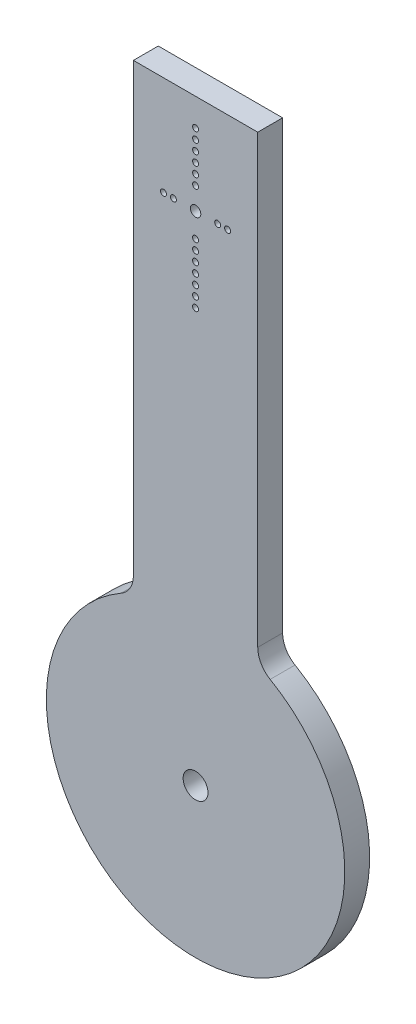
ISO-10303-21;
HEADER;
FILE_DESCRIPTION(('STEP AP214'),'2;1');
FILE_NAME('part.step','',(''),(''),'','','');
FILE_SCHEMA(('AUTOMOTIVE_DESIGN { 1 0 10303 214 1 1 1 1 }'));
ENDSEC;
DATA;
#1=APPLICATION_CONTEXT('core data for automotive mechanical design processes');
#2=APPLICATION_PROTOCOL_DEFINITION('international standard','automotive_design',2000,#1);
#3=PRODUCT_CONTEXT('',#1,'mechanical');
#4=PRODUCT('Part','Part','',(#3));
#5=PRODUCT_RELATED_PRODUCT_CATEGORY('part','',(#4));
#6=PRODUCT_DEFINITION_FORMATION('','',#4);
#7=PRODUCT_DEFINITION_CONTEXT('part definition',#1,'design');
#8=PRODUCT_DEFINITION('design','',#6,#7);
#9=PRODUCT_DEFINITION_SHAPE('','',#8);
#10=(LENGTH_UNIT() NAMED_UNIT(*) SI_UNIT(.MILLI.,.METRE.));
#11=(NAMED_UNIT(*) PLANE_ANGLE_UNIT() SI_UNIT($,.RADIAN.));
#12=(NAMED_UNIT(*) SI_UNIT($,.STERADIAN.) SOLID_ANGLE_UNIT());
#13=UNCERTAINTY_MEASURE_WITH_UNIT(LENGTH_MEASURE(1.E-05),#10,'distance_accuracy_value','');
#14=(GEOMETRIC_REPRESENTATION_CONTEXT(3) GLOBAL_UNCERTAINTY_ASSIGNED_CONTEXT((#13)) GLOBAL_UNIT_ASSIGNED_CONTEXT((#10,
#11,#12)) REPRESENTATION_CONTEXT('',''));
#15=CARTESIAN_POINT('',(0.,0.,0.));
#16=DIRECTION('',(0.,0.,1.));
#17=DIRECTION('',(1.,0.,0.));
#18=AXIS2_PLACEMENT_3D('',#15,#16,#17);
#19=CARTESIAN_POINT('',(-17.5,30.3108891324554,5.));
#20=DIRECTION('',(0.,0.,1.));
#21=DIRECTION('',(1.,0.,0.));
#22=AXIS2_PLACEMENT_3D('',#19,#20,#21);
#23=PLANE('',#22);
#24=CARTESIAN_POINT('',(0.,114.45,5.));
#25=DIRECTION('',(0.,0.,1.));
#26=DIRECTION('',(1.,0.,0.));
#27=AXIS2_PLACEMENT_3D('',#24,#25,#26);
#28=CIRCLE('',#27,0.599999999999914);
#29=CARTESIAN_POINT('',(0.599999999999921,114.45,5.));
#30=VERTEX_POINT('',#29);
#31=EDGE_CURVE('E249',#30,#30,#28,.T.);
#32=ORIENTED_EDGE('',*,*,#31,.F.);
#33=EDGE_LOOP('',(#32));
#34=FACE_BOUND('',#33,.T.);
#35=CARTESIAN_POINT('',(0.,110.45,5.));
#36=DIRECTION('',(0.,0.,1.));
#37=DIRECTION('',(1.,0.,0.));
#38=AXIS2_PLACEMENT_3D('',#35,#36,#37);
#39=CIRCLE('',#38,0.599999999999914);
#40=CARTESIAN_POINT('',(0.599999999999921,110.45,5.));
#41=VERTEX_POINT('',#40);
#42=EDGE_CURVE('E261',#41,#41,#39,.T.);
#43=ORIENTED_EDGE('',*,*,#42,.F.);
#44=EDGE_LOOP('',(#43));
#45=FACE_BOUND('',#44,.T.);
#46=CARTESIAN_POINT('',(0.,106.45,5.));
#47=DIRECTION('',(0.,0.,1.));
#48=DIRECTION('',(1.,0.,0.));
#49=AXIS2_PLACEMENT_3D('',#46,#47,#48);
#50=CIRCLE('',#49,0.599999999999914);
#51=CARTESIAN_POINT('',(0.599999999999921,106.45,5.));
#52=VERTEX_POINT('',#51);
#53=EDGE_CURVE('E273',#52,#52,#50,.T.);
#54=ORIENTED_EDGE('',*,*,#53,.F.);
#55=EDGE_LOOP('',(#54));
#56=FACE_BOUND('',#55,.T.);
#57=CARTESIAN_POINT('',(-6.44999999999999,100.,5.));
#58=DIRECTION('',(0.,0.,1.));
#59=DIRECTION('',(1.,0.,0.));
#60=AXIS2_PLACEMENT_3D('',#57,#58,#59);
#61=CIRCLE('',#60,0.599999999999908);
#62=CARTESIAN_POINT('',(-5.85000000000008,100.,5.));
#63=VERTEX_POINT('',#62);
#64=EDGE_CURVE('E285',#63,#63,#61,.T.);
#65=ORIENTED_EDGE('',*,*,#64,.F.);
#66=EDGE_LOOP('',(#65));
#67=FACE_BOUND('',#66,.T.);
#68=CARTESIAN_POINT('',(4.45000000000001,100.,5.));
#69=DIRECTION('',(0.,0.,1.));
#70=DIRECTION('',(1.,0.,0.));
#71=AXIS2_PLACEMENT_3D('',#68,#69,#70);
#72=CIRCLE('',#71,0.599999999999908);
#73=CARTESIAN_POINT('',(5.04999999999992,100.,5.));
#74=VERTEX_POINT('',#73);
#75=EDGE_CURVE('E297',#74,#74,#72,.T.);
#76=ORIENTED_EDGE('',*,*,#75,.F.);
#77=EDGE_LOOP('',(#76));
#78=FACE_BOUND('',#77,.T.);
#79=CARTESIAN_POINT('',(0.,83.15,5.));
#80=DIRECTION('',(0.,0.,1.));
#81=DIRECTION('',(1.,0.,0.));
#82=AXIS2_PLACEMENT_3D('',#79,#80,#81);
#83=CIRCLE('',#82,0.599999999999914);
#84=CARTESIAN_POINT('',(0.599999999999921,83.15,5.));
#85=VERTEX_POINT('',#84);
#86=EDGE_CURVE('E309',#85,#85,#83,.T.);
#87=ORIENTED_EDGE('',*,*,#86,.F.);
#88=EDGE_LOOP('',(#87));
#89=FACE_BOUND('',#88,.T.);
#90=CARTESIAN_POINT('',(0.,87.15,5.));
#91=DIRECTION('',(0.,0.,1.));
#92=DIRECTION('',(1.,0.,0.));
#93=AXIS2_PLACEMENT_3D('',#90,#91,#92);
#94=CIRCLE('',#93,0.599999999999914);
#95=CARTESIAN_POINT('',(0.599999999999921,87.15,5.));
#96=VERTEX_POINT('',#95);
#97=EDGE_CURVE('E321',#96,#96,#94,.T.);
#98=ORIENTED_EDGE('',*,*,#97,.F.);
#99=EDGE_LOOP('',(#98));
#100=FACE_BOUND('',#99,.T.);
#101=CARTESIAN_POINT('',(0.,91.15,5.));
#102=DIRECTION('',(0.,0.,1.));
#103=DIRECTION('',(1.,0.,0.));
#104=AXIS2_PLACEMENT_3D('',#101,#102,#103);
#105=CIRCLE('',#104,0.599999999999914);
#106=CARTESIAN_POINT('',(0.599999999999921,91.15,5.));
#107=VERTEX_POINT('',#106);
#108=EDGE_CURVE('E333',#107,#107,#105,.T.);
#109=ORIENTED_EDGE('',*,*,#108,.F.);
#110=EDGE_LOOP('',(#109));
#111=FACE_BOUND('',#110,.T.);
#112=CARTESIAN_POINT('',(0.,95.15,5.));
#113=DIRECTION('',(0.,0.,1.));
#114=DIRECTION('',(1.,0.,0.));
#115=AXIS2_PLACEMENT_3D('',#112,#113,#114);
#116=CIRCLE('',#115,0.599999999999914);
#117=CARTESIAN_POINT('',(0.599999999999921,95.15,5.));
#118=VERTEX_POINT('',#117);
#119=EDGE_CURVE('E345',#118,#118,#116,.T.);
#120=ORIENTED_EDGE('',*,*,#119,.F.);
#121=EDGE_LOOP('',(#120));
#122=FACE_BOUND('',#121,.T.);
#123=DIRECTION('',(0.,-1.,0.));
#124=VECTOR('',#123,1.);
#125=CARTESIAN_POINT('',(-12.5,120.,5.));
#126=LINE('',#125,#124);
#127=CARTESIAN_POINT('',(-12.5,120.,5.));
#128=VERTEX_POINT('',#127);
#129=CARTESIAN_POINT('',(-12.5,30.3108891324554,5.));
#130=VERTEX_POINT('',#129);
#131=EDGE_CURVE('E129',#128,#130,#126,.T.);
#132=ORIENTED_EDGE('',*,*,#131,.T.);
#133=CARTESIAN_POINT('',(-17.5,30.3108891324554,5.));
#134=DIRECTION('',(0.,0.,-1.));
#135=DIRECTION('',(1.,0.,0.));
#136=AXIS2_PLACEMENT_3D('',#133,#134,#135);
#137=CIRCLE('',#136,5.);
#138=CARTESIAN_POINT('',(-15.,25.9807621135332,5.));
#139=VERTEX_POINT('',#138);
#140=EDGE_CURVE('E87',#130,#139,#137,.T.);
#141=ORIENTED_EDGE('',*,*,#140,.T.);
#142=CARTESIAN_POINT('',(0.,0.,5.));
#143=DIRECTION('',(0.,0.,1.));
#144=DIRECTION('',(1.,0.,0.));
#145=AXIS2_PLACEMENT_3D('',#142,#143,#144);
#146=CIRCLE('',#145,30.);
#147=CARTESIAN_POINT('',(15.,25.9807621135332,5.));
#148=VERTEX_POINT('',#147);
#149=EDGE_CURVE('E100',#139,#148,#146,.T.);
#150=ORIENTED_EDGE('',*,*,#149,.T.);
#151=CARTESIAN_POINT('',(17.5,30.3108891324554,5.));
#152=DIRECTION('',(0.,0.,-1.));
#153=DIRECTION('',(-1.,0.,0.));
#154=AXIS2_PLACEMENT_3D('',#151,#152,#153);
#155=CIRCLE('',#154,5.);
#156=CARTESIAN_POINT('',(12.5,30.3108891324554,5.));
#157=VERTEX_POINT('',#156);
#158=EDGE_CURVE('E94',#148,#157,#155,.T.);
#159=ORIENTED_EDGE('',*,*,#158,.T.);
#160=DIRECTION('',(0.,1.,0.));
#161=VECTOR('',#160,1.);
#162=CARTESIAN_POINT('',(12.5,120.,5.));
#163=LINE('',#162,#161);
#164=CARTESIAN_POINT('',(12.5,120.,5.));
#165=VERTEX_POINT('',#164);
#166=EDGE_CURVE('E98',#157,#165,#163,.T.);
#167=ORIENTED_EDGE('',*,*,#166,.T.);
#168=DIRECTION('',(-1.,0.,0.));
#169=VECTOR('',#168,1.);
#170=CARTESIAN_POINT('',(-12.5,120.,5.));
#171=LINE('',#170,#169);
#172=EDGE_CURVE('E50',#165,#128,#171,.T.);
#173=ORIENTED_EDGE('',*,*,#172,.T.);
#174=EDGE_LOOP('',(#132,#141,#150,#159,#167,#173));
#175=FACE_BOUND('',#174,.T.);
#176=CARTESIAN_POINT('',(0.,100.,5.));
#177=DIRECTION('',(0.,0.,1.));
#178=DIRECTION('',(1.,0.,0.));
#179=AXIS2_PLACEMENT_3D('',#176,#177,#178);
#180=CIRCLE('',#179,1.0499999999999);
#181=CARTESIAN_POINT('',(1.04999999999991,100.,5.));
#182=VERTEX_POINT('',#181);
#183=EDGE_CURVE('E122',#182,#182,#180,.T.);
#184=ORIENTED_EDGE('',*,*,#183,.F.);
#185=EDGE_LOOP('',(#184));
#186=FACE_BOUND('',#185,.T.);
#187=CARTESIAN_POINT('',(0.,93.15,5.));
#188=DIRECTION('',(0.,0.,1.));
#189=DIRECTION('',(1.,0.,0.));
#190=AXIS2_PLACEMENT_3D('',#187,#188,#189);
#191=CIRCLE('',#190,0.599999999999914);
#192=CARTESIAN_POINT('',(0.599999999999921,93.15,5.));
#193=VERTEX_POINT('',#192);
#194=EDGE_CURVE('E339',#193,#193,#191,.T.);
#195=ORIENTED_EDGE('',*,*,#194,.F.);
#196=EDGE_LOOP('',(#195));
#197=FACE_BOUND('',#196,.T.);
#198=CARTESIAN_POINT('',(0.,89.15,5.));
#199=DIRECTION('',(0.,0.,1.));
#200=DIRECTION('',(1.,0.,0.));
#201=AXIS2_PLACEMENT_3D('',#198,#199,#200);
#202=CIRCLE('',#201,0.599999999999914);
#203=CARTESIAN_POINT('',(0.599999999999921,89.15,5.));
#204=VERTEX_POINT('',#203);
#205=EDGE_CURVE('E327',#204,#204,#202,.T.);
#206=ORIENTED_EDGE('',*,*,#205,.F.);
#207=EDGE_LOOP('',(#206));
#208=FACE_BOUND('',#207,.T.);
#209=CARTESIAN_POINT('',(0.,85.15,5.));
#210=DIRECTION('',(0.,0.,1.));
#211=DIRECTION('',(1.,0.,0.));
#212=AXIS2_PLACEMENT_3D('',#209,#210,#211);
#213=CIRCLE('',#212,0.599999999999914);
#214=CARTESIAN_POINT('',(0.599999999999921,85.15,5.));
#215=VERTEX_POINT('',#214);
#216=EDGE_CURVE('E315',#215,#215,#213,.T.);
#217=ORIENTED_EDGE('',*,*,#216,.F.);
#218=EDGE_LOOP('',(#217));
#219=FACE_BOUND('',#218,.T.);
#220=CARTESIAN_POINT('',(6.45000000000001,100.,5.));
#221=DIRECTION('',(0.,0.,1.));
#222=DIRECTION('',(1.,0.,0.));
#223=AXIS2_PLACEMENT_3D('',#220,#221,#222);
#224=CIRCLE('',#223,0.599999999999908);
#225=CARTESIAN_POINT('',(7.04999999999992,100.,5.));
#226=VERTEX_POINT('',#225);
#227=EDGE_CURVE('E303',#226,#226,#224,.T.);
#228=ORIENTED_EDGE('',*,*,#227,.F.);
#229=EDGE_LOOP('',(#228));
#230=FACE_BOUND('',#229,.T.);
#231=CARTESIAN_POINT('',(-4.44999999999999,100.,5.));
#232=DIRECTION('',(0.,0.,1.));
#233=DIRECTION('',(1.,0.,0.));
#234=AXIS2_PLACEMENT_3D('',#231,#232,#233);
#235=CIRCLE('',#234,0.599999999999908);
#236=CARTESIAN_POINT('',(-3.85000000000008,100.,5.));
#237=VERTEX_POINT('',#236);
#238=EDGE_CURVE('E291',#237,#237,#235,.T.);
#239=ORIENTED_EDGE('',*,*,#238,.F.);
#240=EDGE_LOOP('',(#239));
#241=FACE_BOUND('',#240,.T.);
#242=CARTESIAN_POINT('',(0.,104.45,5.));
#243=DIRECTION('',(0.,0.,1.));
#244=DIRECTION('',(1.,0.,0.));
#245=AXIS2_PLACEMENT_3D('',#242,#243,#244);
#246=CIRCLE('',#245,0.599999999999914);
#247=CARTESIAN_POINT('',(0.599999999999921,104.45,5.));
#248=VERTEX_POINT('',#247);
#249=EDGE_CURVE('E279',#248,#248,#246,.T.);
#250=ORIENTED_EDGE('',*,*,#249,.F.);
#251=EDGE_LOOP('',(#250));
#252=FACE_BOUND('',#251,.T.);
#253=CARTESIAN_POINT('',(0.,108.45,5.));
#254=DIRECTION('',(0.,0.,1.));
#255=DIRECTION('',(1.,0.,0.));
#256=AXIS2_PLACEMENT_3D('',#253,#254,#255);
#257=CIRCLE('',#256,0.599999999999914);
#258=CARTESIAN_POINT('',(0.599999999999921,108.45,5.));
#259=VERTEX_POINT('',#258);
#260=EDGE_CURVE('E267',#259,#259,#257,.T.);
#261=ORIENTED_EDGE('',*,*,#260,.F.);
#262=EDGE_LOOP('',(#261));
#263=FACE_BOUND('',#262,.T.);
#264=CARTESIAN_POINT('',(0.,112.45,5.));
#265=DIRECTION('',(0.,0.,1.));
#266=DIRECTION('',(1.,0.,0.));
#267=AXIS2_PLACEMENT_3D('',#264,#265,#266);
#268=CIRCLE('',#267,0.599999999999914);
#269=CARTESIAN_POINT('',(0.599999999999921,112.45,5.));
#270=VERTEX_POINT('',#269);
#271=EDGE_CURVE('E255',#270,#270,#268,.T.);
#272=ORIENTED_EDGE('',*,*,#271,.F.);
#273=EDGE_LOOP('',(#272));
#274=FACE_BOUND('',#273,.T.);
#275=CARTESIAN_POINT('',(0.,0.,5.));
#276=DIRECTION('',(0.,0.,1.));
#277=DIRECTION('',(1.,0.,0.));
#278=AXIS2_PLACEMENT_3D('',#275,#276,#277);
#279=CIRCLE('',#278,2.5);
#280=CARTESIAN_POINT('',(2.5,0.,5.));
#281=VERTEX_POINT('',#280);
#282=EDGE_CURVE('E240',#281,#281,#279,.T.);
#283=ORIENTED_EDGE('',*,*,#282,.F.);
#284=EDGE_LOOP('',(#283));
#285=FACE_BOUND('',#284,.T.);
#286=ADVANCED_FACE('F33',(#34,#45,#56,#67,#78,#89,#100,#111,#122,#175,#186,#197,#208,#219,#230,
#241,#252,#263,#274,#285),#23,.T.);
#287=CARTESIAN_POINT('',(-17.5,30.3108891324554,0.));
#288=DIRECTION('',(0.,0.,1.));
#289=DIRECTION('',(1.,0.,0.));
#290=AXIS2_PLACEMENT_3D('',#287,#288,#289);
#291=PLANE('',#290);
#292=DIRECTION('',(0.,-1.,0.));
#293=VECTOR('',#292,1.);
#294=CARTESIAN_POINT('',(-12.5,120.,0.));
#295=LINE('',#294,#293);
#296=CARTESIAN_POINT('',(-12.5,120.,0.));
#297=VERTEX_POINT('',#296);
#298=CARTESIAN_POINT('',(-12.5,30.3108891324554,0.));
#299=VERTEX_POINT('',#298);
#300=EDGE_CURVE('E118',#297,#299,#295,.T.);
#301=ORIENTED_EDGE('',*,*,#300,.F.);
#302=DIRECTION('',(-1.,0.,0.));
#303=VECTOR('',#302,1.);
#304=CARTESIAN_POINT('',(-12.5,120.,0.));
#305=LINE('',#304,#303);
#306=CARTESIAN_POINT('',(12.5,120.,0.));
#307=VERTEX_POINT('',#306);
#308=EDGE_CURVE('E79',#307,#297,#305,.T.);
#309=ORIENTED_EDGE('',*,*,#308,.F.);
#310=DIRECTION('',(0.,1.,0.));
#311=VECTOR('',#310,1.);
#312=CARTESIAN_POINT('',(12.5,120.,0.));
#313=LINE('',#312,#311);
#314=CARTESIAN_POINT('',(12.5,30.3108891324554,0.));
#315=VERTEX_POINT('',#314);
#316=EDGE_CURVE('E73',#315,#307,#313,.T.);
#317=ORIENTED_EDGE('',*,*,#316,.F.);
#318=CARTESIAN_POINT('',(17.5,30.3108891324554,0.));
#319=DIRECTION('',(0.,0.,-1.));
#320=DIRECTION('',(-1.,0.,0.));
#321=AXIS2_PLACEMENT_3D('',#318,#319,#320);
#322=CIRCLE('',#321,5.);
#323=CARTESIAN_POINT('',(15.,25.9807621135332,0.));
#324=VERTEX_POINT('',#323);
#325=EDGE_CURVE('E108',#324,#315,#322,.T.);
#326=ORIENTED_EDGE('',*,*,#325,.F.);
#327=CARTESIAN_POINT('',(0.,0.,0.));
#328=DIRECTION('',(0.,0.,1.));
#329=DIRECTION('',(1.,0.,0.));
#330=AXIS2_PLACEMENT_3D('',#327,#328,#329);
#331=CIRCLE('',#330,30.);
#332=CARTESIAN_POINT('',(-15.,25.9807621135332,0.));
#333=VERTEX_POINT('',#332);
#334=EDGE_CURVE('E124',#333,#324,#331,.T.);
#335=ORIENTED_EDGE('',*,*,#334,.F.);
#336=CARTESIAN_POINT('',(-17.5,30.3108891324554,0.));
#337=DIRECTION('',(0.,0.,-1.));
#338=DIRECTION('',(1.,0.,0.));
#339=AXIS2_PLACEMENT_3D('',#336,#337,#338);
#340=CIRCLE('',#339,5.);
#341=EDGE_CURVE('E121',#299,#333,#340,.T.);
#342=ORIENTED_EDGE('',*,*,#341,.F.);
#343=EDGE_LOOP('',(#301,#309,#317,#326,#335,#342));
#344=FACE_BOUND('',#343,.T.);
#345=CARTESIAN_POINT('',(0.,100.,0.));
#346=DIRECTION('',(0.,0.,1.));
#347=DIRECTION('',(1.,0.,0.));
#348=AXIS2_PLACEMENT_3D('',#345,#346,#347);
#349=CIRCLE('',#348,1.0499999999999);
#350=CARTESIAN_POINT('',(1.04999999999991,100.,0.));
#351=VERTEX_POINT('',#350);
#352=EDGE_CURVE('E348',#351,#351,#349,.T.);
#353=ORIENTED_EDGE('',*,*,#352,.T.);
#354=EDGE_LOOP('',(#353));
#355=FACE_BOUND('',#354,.T.);
#356=CARTESIAN_POINT('',(0.,95.15,0.));
#357=DIRECTION('',(0.,0.,1.));
#358=DIRECTION('',(1.,0.,0.));
#359=AXIS2_PLACEMENT_3D('',#356,#357,#358);
#360=CIRCLE('',#359,0.599999999999914);
#361=CARTESIAN_POINT('',(0.599999999999921,95.15,0.));
#362=VERTEX_POINT('',#361);
#363=EDGE_CURVE('E342',#362,#362,#360,.T.);
#364=ORIENTED_EDGE('',*,*,#363,.T.);
#365=EDGE_LOOP('',(#364));
#366=FACE_BOUND('',#365,.T.);
#367=CARTESIAN_POINT('',(0.,93.15,0.));
#368=DIRECTION('',(0.,0.,1.));
#369=DIRECTION('',(1.,0.,0.));
#370=AXIS2_PLACEMENT_3D('',#367,#368,#369);
#371=CIRCLE('',#370,0.599999999999914);
#372=CARTESIAN_POINT('',(0.599999999999921,93.15,0.));
#373=VERTEX_POINT('',#372);
#374=EDGE_CURVE('E336',#373,#373,#371,.T.);
#375=ORIENTED_EDGE('',*,*,#374,.T.);
#376=EDGE_LOOP('',(#375));
#377=FACE_BOUND('',#376,.T.);
#378=CARTESIAN_POINT('',(0.,91.15,0.));
#379=DIRECTION('',(0.,0.,1.));
#380=DIRECTION('',(1.,0.,0.));
#381=AXIS2_PLACEMENT_3D('',#378,#379,#380);
#382=CIRCLE('',#381,0.599999999999914);
#383=CARTESIAN_POINT('',(0.599999999999921,91.15,0.));
#384=VERTEX_POINT('',#383);
#385=EDGE_CURVE('E330',#384,#384,#382,.T.);
#386=ORIENTED_EDGE('',*,*,#385,.T.);
#387=EDGE_LOOP('',(#386));
#388=FACE_BOUND('',#387,.T.);
#389=CARTESIAN_POINT('',(0.,89.15,0.));
#390=DIRECTION('',(0.,0.,1.));
#391=DIRECTION('',(1.,0.,0.));
#392=AXIS2_PLACEMENT_3D('',#389,#390,#391);
#393=CIRCLE('',#392,0.599999999999914);
#394=CARTESIAN_POINT('',(0.599999999999921,89.15,0.));
#395=VERTEX_POINT('',#394);
#396=EDGE_CURVE('E324',#395,#395,#393,.T.);
#397=ORIENTED_EDGE('',*,*,#396,.T.);
#398=EDGE_LOOP('',(#397));
#399=FACE_BOUND('',#398,.T.);
#400=CARTESIAN_POINT('',(0.,87.15,0.));
#401=DIRECTION('',(0.,0.,1.));
#402=DIRECTION('',(1.,0.,0.));
#403=AXIS2_PLACEMENT_3D('',#400,#401,#402);
#404=CIRCLE('',#403,0.599999999999914);
#405=CARTESIAN_POINT('',(0.599999999999921,87.15,0.));
#406=VERTEX_POINT('',#405);
#407=EDGE_CURVE('E318',#406,#406,#404,.T.);
#408=ORIENTED_EDGE('',*,*,#407,.T.);
#409=EDGE_LOOP('',(#408));
#410=FACE_BOUND('',#409,.T.);
#411=CARTESIAN_POINT('',(0.,85.15,0.));
#412=DIRECTION('',(0.,0.,1.));
#413=DIRECTION('',(1.,0.,0.));
#414=AXIS2_PLACEMENT_3D('',#411,#412,#413);
#415=CIRCLE('',#414,0.599999999999914);
#416=CARTESIAN_POINT('',(0.599999999999921,85.15,0.));
#417=VERTEX_POINT('',#416);
#418=EDGE_CURVE('E312',#417,#417,#415,.T.);
#419=ORIENTED_EDGE('',*,*,#418,.T.);
#420=EDGE_LOOP('',(#419));
#421=FACE_BOUND('',#420,.T.);
#422=CARTESIAN_POINT('',(0.,83.15,0.));
#423=DIRECTION('',(0.,0.,1.));
#424=DIRECTION('',(1.,0.,0.));
#425=AXIS2_PLACEMENT_3D('',#422,#423,#424);
#426=CIRCLE('',#425,0.599999999999914);
#427=CARTESIAN_POINT('',(0.599999999999921,83.15,0.));
#428=VERTEX_POINT('',#427);
#429=EDGE_CURVE('E306',#428,#428,#426,.T.);
#430=ORIENTED_EDGE('',*,*,#429,.T.);
#431=EDGE_LOOP('',(#430));
#432=FACE_BOUND('',#431,.T.);
#433=CARTESIAN_POINT('',(6.45000000000001,100.,0.));
#434=DIRECTION('',(0.,0.,1.));
#435=DIRECTION('',(1.,0.,0.));
#436=AXIS2_PLACEMENT_3D('',#433,#434,#435);
#437=CIRCLE('',#436,0.599999999999908);
#438=CARTESIAN_POINT('',(7.04999999999992,100.,0.));
#439=VERTEX_POINT('',#438);
#440=EDGE_CURVE('E300',#439,#439,#437,.T.);
#441=ORIENTED_EDGE('',*,*,#440,.T.);
#442=EDGE_LOOP('',(#441));
#443=FACE_BOUND('',#442,.T.);
#444=CARTESIAN_POINT('',(4.45000000000001,100.,0.));
#445=DIRECTION('',(0.,0.,1.));
#446=DIRECTION('',(1.,0.,0.));
#447=AXIS2_PLACEMENT_3D('',#444,#445,#446);
#448=CIRCLE('',#447,0.599999999999908);
#449=CARTESIAN_POINT('',(5.04999999999992,100.,0.));
#450=VERTEX_POINT('',#449);
#451=EDGE_CURVE('E294',#450,#450,#448,.T.);
#452=ORIENTED_EDGE('',*,*,#451,.T.);
#453=EDGE_LOOP('',(#452));
#454=FACE_BOUND('',#453,.T.);
#455=CARTESIAN_POINT('',(-4.44999999999999,100.,0.));
#456=DIRECTION('',(0.,0.,1.));
#457=DIRECTION('',(1.,0.,0.));
#458=AXIS2_PLACEMENT_3D('',#455,#456,#457);
#459=CIRCLE('',#458,0.599999999999908);
#460=CARTESIAN_POINT('',(-3.85000000000008,100.,0.));
#461=VERTEX_POINT('',#460);
#462=EDGE_CURVE('E288',#461,#461,#459,.T.);
#463=ORIENTED_EDGE('',*,*,#462,.T.);
#464=EDGE_LOOP('',(#463));
#465=FACE_BOUND('',#464,.T.);
#466=CARTESIAN_POINT('',(-6.44999999999999,100.,0.));
#467=DIRECTION('',(0.,0.,1.));
#468=DIRECTION('',(1.,0.,0.));
#469=AXIS2_PLACEMENT_3D('',#466,#467,#468);
#470=CIRCLE('',#469,0.599999999999908);
#471=CARTESIAN_POINT('',(-5.85000000000008,100.,0.));
#472=VERTEX_POINT('',#471);
#473=EDGE_CURVE('E282',#472,#472,#470,.T.);
#474=ORIENTED_EDGE('',*,*,#473,.T.);
#475=EDGE_LOOP('',(#474));
#476=FACE_BOUND('',#475,.T.);
#477=CARTESIAN_POINT('',(0.,104.45,0.));
#478=DIRECTION('',(0.,0.,1.));
#479=DIRECTION('',(1.,0.,0.));
#480=AXIS2_PLACEMENT_3D('',#477,#478,#479);
#481=CIRCLE('',#480,0.599999999999914);
#482=CARTESIAN_POINT('',(0.599999999999921,104.45,0.));
#483=VERTEX_POINT('',#482);
#484=EDGE_CURVE('E276',#483,#483,#481,.T.);
#485=ORIENTED_EDGE('',*,*,#484,.T.);
#486=EDGE_LOOP('',(#485));
#487=FACE_BOUND('',#486,.T.);
#488=CARTESIAN_POINT('',(0.,106.45,0.));
#489=DIRECTION('',(0.,0.,1.));
#490=DIRECTION('',(1.,0.,0.));
#491=AXIS2_PLACEMENT_3D('',#488,#489,#490);
#492=CIRCLE('',#491,0.599999999999914);
#493=CARTESIAN_POINT('',(0.599999999999921,106.45,0.));
#494=VERTEX_POINT('',#493);
#495=EDGE_CURVE('E270',#494,#494,#492,.T.);
#496=ORIENTED_EDGE('',*,*,#495,.T.);
#497=EDGE_LOOP('',(#496));
#498=FACE_BOUND('',#497,.T.);
#499=CARTESIAN_POINT('',(0.,108.45,0.));
#500=DIRECTION('',(0.,0.,1.));
#501=DIRECTION('',(1.,0.,0.));
#502=AXIS2_PLACEMENT_3D('',#499,#500,#501);
#503=CIRCLE('',#502,0.599999999999914);
#504=CARTESIAN_POINT('',(0.599999999999921,108.45,0.));
#505=VERTEX_POINT('',#504);
#506=EDGE_CURVE('E264',#505,#505,#503,.T.);
#507=ORIENTED_EDGE('',*,*,#506,.T.);
#508=EDGE_LOOP('',(#507));
#509=FACE_BOUND('',#508,.T.);
#510=CARTESIAN_POINT('',(0.,110.45,0.));
#511=DIRECTION('',(0.,0.,1.));
#512=DIRECTION('',(1.,0.,0.));
#513=AXIS2_PLACEMENT_3D('',#510,#511,#512);
#514=CIRCLE('',#513,0.599999999999914);
#515=CARTESIAN_POINT('',(0.599999999999921,110.45,0.));
#516=VERTEX_POINT('',#515);
#517=EDGE_CURVE('E258',#516,#516,#514,.T.);
#518=ORIENTED_EDGE('',*,*,#517,.T.);
#519=EDGE_LOOP('',(#518));
#520=FACE_BOUND('',#519,.T.);
#521=CARTESIAN_POINT('',(0.,112.45,0.));
#522=DIRECTION('',(0.,0.,1.));
#523=DIRECTION('',(1.,0.,0.));
#524=AXIS2_PLACEMENT_3D('',#521,#522,#523);
#525=CIRCLE('',#524,0.599999999999914);
#526=CARTESIAN_POINT('',(0.599999999999921,112.45,0.));
#527=VERTEX_POINT('',#526);
#528=EDGE_CURVE('E252',#527,#527,#525,.T.);
#529=ORIENTED_EDGE('',*,*,#528,.T.);
#530=EDGE_LOOP('',(#529));
#531=FACE_BOUND('',#530,.T.);
#532=CARTESIAN_POINT('',(0.,114.45,0.));
#533=DIRECTION('',(0.,0.,1.));
#534=DIRECTION('',(1.,0.,0.));
#535=AXIS2_PLACEMENT_3D('',#532,#533,#534);
#536=CIRCLE('',#535,0.599999999999914);
#537=CARTESIAN_POINT('',(0.599999999999921,114.45,0.));
#538=VERTEX_POINT('',#537);
#539=EDGE_CURVE('E246',#538,#538,#536,.T.);
#540=ORIENTED_EDGE('',*,*,#539,.T.);
#541=EDGE_LOOP('',(#540));
#542=FACE_BOUND('',#541,.T.);
#543=CARTESIAN_POINT('',(0.,0.,0.));
#544=DIRECTION('',(0.,0.,1.));
#545=DIRECTION('',(1.,0.,0.));
#546=AXIS2_PLACEMENT_3D('',#543,#544,#545);
#547=CIRCLE('',#546,2.5);
#548=CARTESIAN_POINT('',(2.5,0.,0.));
#549=VERTEX_POINT('',#548);
#550=EDGE_CURVE('E243',#549,#549,#547,.T.);
#551=ORIENTED_EDGE('',*,*,#550,.T.);
#552=EDGE_LOOP('',(#551));
#553=FACE_BOUND('',#552,.T.);
#554=ADVANCED_FACE('F138',(#344,#355,#366,#377,#388,#399,#410,#421,#432,#443,#454,#465,#476,
#487,#498,#509,#520,#531,#542,#553),#291,.F.);
#555=CARTESIAN_POINT('',(-12.5,120.,5.));
#556=DIRECTION('',(1.,0.,0.));
#557=DIRECTION('',(0.,1.,0.));
#558=AXIS2_PLACEMENT_3D('',#555,#556,#557);
#559=PLANE('',#558);
#560=ORIENTED_EDGE('',*,*,#300,.T.);
#561=DIRECTION('',(0.,0.,-1.));
#562=VECTOR('',#561,1.);
#563=CARTESIAN_POINT('',(-12.5,30.3108891324554,5.));
#564=LINE('',#563,#562);
#565=EDGE_CURVE('E11',#130,#299,#564,.T.);
#566=ORIENTED_EDGE('',*,*,#565,.F.);
#567=ORIENTED_EDGE('',*,*,#131,.F.);
#568=DIRECTION('',(0.,0.,-1.));
#569=VECTOR('',#568,1.);
#570=CARTESIAN_POINT('',(-12.5,120.,5.));
#571=LINE('',#570,#569);
#572=EDGE_CURVE('E114',#128,#297,#571,.T.);
#573=ORIENTED_EDGE('',*,*,#572,.T.);
#574=EDGE_LOOP('',(#560,#566,#567,#573));
#575=FACE_BOUND('',#574,.T.);
#576=ADVANCED_FACE('F35',(#575),#559,.F.);
#577=CARTESIAN_POINT('',(-17.5,30.3108891324554,5.));
#578=DIRECTION('',(0.,0.,-1.));
#579=DIRECTION('',(-1.,0.,0.));
#580=AXIS2_PLACEMENT_3D('',#577,#578,#579);
#581=CYLINDRICAL_SURFACE('',#580,5.);
#582=ORIENTED_EDGE('',*,*,#341,.T.);
#583=DIRECTION('',(0.,0.,-1.));
#584=VECTOR('',#583,1.);
#585=CARTESIAN_POINT('',(-15.,25.9807621135332,5.));
#586=LINE('',#585,#584);
#587=EDGE_CURVE('E42',#139,#333,#586,.T.);
#588=ORIENTED_EDGE('',*,*,#587,.F.);
#589=ORIENTED_EDGE('',*,*,#140,.F.);
#590=ORIENTED_EDGE('',*,*,#565,.T.);
#591=EDGE_LOOP('',(#582,#588,#589,#590));
#592=FACE_BOUND('',#591,.T.);
#593=ADVANCED_FACE('F541',(#592),#581,.F.);
#594=CARTESIAN_POINT('',(0.,0.,5.));
#595=DIRECTION('',(0.,0.,-1.));
#596=DIRECTION('',(-1.,0.,0.));
#597=AXIS2_PLACEMENT_3D('',#594,#595,#596);
#598=CYLINDRICAL_SURFACE('',#597,30.);
#599=ORIENTED_EDGE('',*,*,#334,.T.);
#600=DIRECTION('',(0.,0.,-1.));
#601=VECTOR('',#600,1.);
#602=CARTESIAN_POINT('',(15.,25.9807621135332,5.));
#603=LINE('',#602,#601);
#604=EDGE_CURVE('E109',#148,#324,#603,.T.);
#605=ORIENTED_EDGE('',*,*,#604,.F.);
#606=ORIENTED_EDGE('',*,*,#149,.F.);
#607=ORIENTED_EDGE('',*,*,#587,.T.);
#608=EDGE_LOOP('',(#599,#605,#606,#607));
#609=FACE_BOUND('',#608,.T.);
#610=ADVANCED_FACE('F135',(#609),#598,.T.);
#611=CARTESIAN_POINT('',(17.5,30.3108891324554,5.));
#612=DIRECTION('',(0.,0.,-1.));
#613=DIRECTION('',(-1.,0.,0.));
#614=AXIS2_PLACEMENT_3D('',#611,#612,#613);
#615=CYLINDRICAL_SURFACE('',#614,5.);
#616=ORIENTED_EDGE('',*,*,#325,.T.);
#617=DIRECTION('',(0.,0.,-1.));
#618=VECTOR('',#617,1.);
#619=CARTESIAN_POINT('',(12.5,30.3108891324554,5.));
#620=LINE('',#619,#618);
#621=EDGE_CURVE('E105',#157,#315,#620,.T.);
#622=ORIENTED_EDGE('',*,*,#621,.F.);
#623=ORIENTED_EDGE('',*,*,#158,.F.);
#624=ORIENTED_EDGE('',*,*,#604,.T.);
#625=EDGE_LOOP('',(#616,#622,#623,#624));
#626=FACE_BOUND('',#625,.T.);
#627=ADVANCED_FACE('F106',(#626),#615,.F.);
#628=CARTESIAN_POINT('',(12.5,120.,5.));
#629=DIRECTION('',(-1.,0.,0.));
#630=DIRECTION('',(0.,-1.,0.));
#631=AXIS2_PLACEMENT_3D('',#628,#629,#630);
#632=PLANE('',#631);
#633=ORIENTED_EDGE('',*,*,#316,.T.);
#634=DIRECTION('',(0.,0.,-1.));
#635=VECTOR('',#634,1.);
#636=CARTESIAN_POINT('',(12.5,120.,5.));
#637=LINE('',#636,#635);
#638=EDGE_CURVE('E110',#165,#307,#637,.T.);
#639=ORIENTED_EDGE('',*,*,#638,.F.);
#640=ORIENTED_EDGE('',*,*,#166,.F.);
#641=ORIENTED_EDGE('',*,*,#621,.T.);
#642=EDGE_LOOP('',(#633,#639,#640,#641));
#643=FACE_BOUND('',#642,.T.);
#644=ADVANCED_FACE('F112',(#643),#632,.F.);
#645=CARTESIAN_POINT('',(-12.5,120.,5.));
#646=DIRECTION('',(0.,-1.,0.));
#647=DIRECTION('',(0.,0.,-1.));
#648=AXIS2_PLACEMENT_3D('',#645,#646,#647);
#649=PLANE('',#648);
#650=ORIENTED_EDGE('',*,*,#308,.T.);
#651=ORIENTED_EDGE('',*,*,#572,.F.);
#652=ORIENTED_EDGE('',*,*,#172,.F.);
#653=ORIENTED_EDGE('',*,*,#638,.T.);
#654=EDGE_LOOP('',(#650,#651,#652,#653));
#655=FACE_BOUND('',#654,.T.);
#656=ADVANCED_FACE('F143',(#655),#649,.F.);
#657=CARTESIAN_POINT('',(0.,100.,5.));
#658=DIRECTION('',(0.,0.,-1.));
#659=DIRECTION('',(-1.,0.,0.));
#660=AXIS2_PLACEMENT_3D('',#657,#658,#659);
#661=CYLINDRICAL_SURFACE('',#660,1.0499999999999);
#662=ORIENTED_EDGE('',*,*,#183,.T.);
#663=EDGE_LOOP('',(#662));
#664=FACE_BOUND('',#663,.T.);
#665=ORIENTED_EDGE('',*,*,#352,.F.);
#666=EDGE_LOOP('',(#665));
#667=FACE_BOUND('',#666,.T.);
#668=ADVANCED_FACE('F145',(#664,#667),#661,.F.);
#669=CARTESIAN_POINT('',(0.,95.15,5.));
#670=DIRECTION('',(0.,0.,-1.));
#671=DIRECTION('',(-1.,0.,0.));
#672=AXIS2_PLACEMENT_3D('',#669,#670,#671);
#673=CYLINDRICAL_SURFACE('',#672,0.599999999999914);
#674=ORIENTED_EDGE('',*,*,#119,.T.);
#675=EDGE_LOOP('',(#674));
#676=FACE_BOUND('',#675,.T.);
#677=ORIENTED_EDGE('',*,*,#363,.F.);
#678=EDGE_LOOP('',(#677));
#679=FACE_BOUND('',#678,.T.);
#680=ADVANCED_FACE('F151',(#676,#679),#673,.F.);
#681=CARTESIAN_POINT('',(0.,93.15,5.));
#682=DIRECTION('',(0.,0.,-1.));
#683=DIRECTION('',(-1.,0.,0.));
#684=AXIS2_PLACEMENT_3D('',#681,#682,#683);
#685=CYLINDRICAL_SURFACE('',#684,0.599999999999914);
#686=ORIENTED_EDGE('',*,*,#194,.T.);
#687=EDGE_LOOP('',(#686));
#688=FACE_BOUND('',#687,.T.);
#689=ORIENTED_EDGE('',*,*,#374,.F.);
#690=EDGE_LOOP('',(#689));
#691=FACE_BOUND('',#690,.T.);
#692=ADVANCED_FACE('F167',(#688,#691),#685,.F.);
#693=CARTESIAN_POINT('',(0.,91.15,5.));
#694=DIRECTION('',(0.,0.,-1.));
#695=DIRECTION('',(-1.,0.,0.));
#696=AXIS2_PLACEMENT_3D('',#693,#694,#695);
#697=CYLINDRICAL_SURFACE('',#696,0.599999999999914);
#698=ORIENTED_EDGE('',*,*,#108,.T.);
#699=EDGE_LOOP('',(#698));
#700=FACE_BOUND('',#699,.T.);
#701=ORIENTED_EDGE('',*,*,#385,.F.);
#702=EDGE_LOOP('',(#701));
#703=FACE_BOUND('',#702,.T.);
#704=ADVANCED_FACE('F171',(#700,#703),#697,.F.);
#705=CARTESIAN_POINT('',(0.,89.15,5.));
#706=DIRECTION('',(0.,0.,-1.));
#707=DIRECTION('',(-1.,0.,0.));
#708=AXIS2_PLACEMENT_3D('',#705,#706,#707);
#709=CYLINDRICAL_SURFACE('',#708,0.599999999999914);
#710=ORIENTED_EDGE('',*,*,#205,.T.);
#711=EDGE_LOOP('',(#710));
#712=FACE_BOUND('',#711,.T.);
#713=ORIENTED_EDGE('',*,*,#396,.F.);
#714=EDGE_LOOP('',(#713));
#715=FACE_BOUND('',#714,.T.);
#716=ADVANCED_FACE('F175',(#712,#715),#709,.F.);
#717=CARTESIAN_POINT('',(0.,87.15,5.));
#718=DIRECTION('',(0.,0.,-1.));
#719=DIRECTION('',(-1.,0.,0.));
#720=AXIS2_PLACEMENT_3D('',#717,#718,#719);
#721=CYLINDRICAL_SURFACE('',#720,0.599999999999914);
#722=ORIENTED_EDGE('',*,*,#97,.T.);
#723=EDGE_LOOP('',(#722));
#724=FACE_BOUND('',#723,.T.);
#725=ORIENTED_EDGE('',*,*,#407,.F.);
#726=EDGE_LOOP('',(#725));
#727=FACE_BOUND('',#726,.T.);
#728=ADVANCED_FACE('F179',(#724,#727),#721,.F.);
#729=CARTESIAN_POINT('',(0.,85.15,5.));
#730=DIRECTION('',(0.,0.,-1.));
#731=DIRECTION('',(-1.,0.,0.));
#732=AXIS2_PLACEMENT_3D('',#729,#730,#731);
#733=CYLINDRICAL_SURFACE('',#732,0.599999999999914);
#734=ORIENTED_EDGE('',*,*,#216,.T.);
#735=EDGE_LOOP('',(#734));
#736=FACE_BOUND('',#735,.T.);
#737=ORIENTED_EDGE('',*,*,#418,.F.);
#738=EDGE_LOOP('',(#737));
#739=FACE_BOUND('',#738,.T.);
#740=ADVANCED_FACE('F183',(#736,#739),#733,.F.);
#741=CARTESIAN_POINT('',(0.,83.15,5.));
#742=DIRECTION('',(0.,0.,-1.));
#743=DIRECTION('',(-1.,0.,0.));
#744=AXIS2_PLACEMENT_3D('',#741,#742,#743);
#745=CYLINDRICAL_SURFACE('',#744,0.599999999999914);
#746=ORIENTED_EDGE('',*,*,#86,.T.);
#747=EDGE_LOOP('',(#746));
#748=FACE_BOUND('',#747,.T.);
#749=ORIENTED_EDGE('',*,*,#429,.F.);
#750=EDGE_LOOP('',(#749));
#751=FACE_BOUND('',#750,.T.);
#752=ADVANCED_FACE('F187',(#748,#751),#745,.F.);
#753=CARTESIAN_POINT('',(6.45000000000001,100.,5.));
#754=DIRECTION('',(0.,0.,-1.));
#755=DIRECTION('',(-1.,0.,0.));
#756=AXIS2_PLACEMENT_3D('',#753,#754,#755);
#757=CYLINDRICAL_SURFACE('',#756,0.599999999999908);
#758=ORIENTED_EDGE('',*,*,#227,.T.);
#759=EDGE_LOOP('',(#758));
#760=FACE_BOUND('',#759,.T.);
#761=ORIENTED_EDGE('',*,*,#440,.F.);
#762=EDGE_LOOP('',(#761));
#763=FACE_BOUND('',#762,.T.);
#764=ADVANCED_FACE('F191',(#760,#763),#757,.F.);
#765=CARTESIAN_POINT('',(4.45000000000001,100.,5.));
#766=DIRECTION('',(0.,0.,-1.));
#767=DIRECTION('',(-1.,0.,0.));
#768=AXIS2_PLACEMENT_3D('',#765,#766,#767);
#769=CYLINDRICAL_SURFACE('',#768,0.599999999999908);
#770=ORIENTED_EDGE('',*,*,#75,.T.);
#771=EDGE_LOOP('',(#770));
#772=FACE_BOUND('',#771,.T.);
#773=ORIENTED_EDGE('',*,*,#451,.F.);
#774=EDGE_LOOP('',(#773));
#775=FACE_BOUND('',#774,.T.);
#776=ADVANCED_FACE('F195',(#772,#775),#769,.F.);
#777=CARTESIAN_POINT('',(-4.44999999999999,100.,5.));
#778=DIRECTION('',(0.,0.,-1.));
#779=DIRECTION('',(-1.,0.,0.));
#780=AXIS2_PLACEMENT_3D('',#777,#778,#779);
#781=CYLINDRICAL_SURFACE('',#780,0.599999999999908);
#782=ORIENTED_EDGE('',*,*,#238,.T.);
#783=EDGE_LOOP('',(#782));
#784=FACE_BOUND('',#783,.T.);
#785=ORIENTED_EDGE('',*,*,#462,.F.);
#786=EDGE_LOOP('',(#785));
#787=FACE_BOUND('',#786,.T.);
#788=ADVANCED_FACE('F199',(#784,#787),#781,.F.);
#789=CARTESIAN_POINT('',(-6.44999999999999,100.,5.));
#790=DIRECTION('',(0.,0.,-1.));
#791=DIRECTION('',(-1.,0.,0.));
#792=AXIS2_PLACEMENT_3D('',#789,#790,#791);
#793=CYLINDRICAL_SURFACE('',#792,0.599999999999908);
#794=ORIENTED_EDGE('',*,*,#64,.T.);
#795=EDGE_LOOP('',(#794));
#796=FACE_BOUND('',#795,.T.);
#797=ORIENTED_EDGE('',*,*,#473,.F.);
#798=EDGE_LOOP('',(#797));
#799=FACE_BOUND('',#798,.T.);
#800=ADVANCED_FACE('F203',(#796,#799),#793,.F.);
#801=CARTESIAN_POINT('',(0.,104.45,5.));
#802=DIRECTION('',(0.,0.,-1.));
#803=DIRECTION('',(-1.,0.,0.));
#804=AXIS2_PLACEMENT_3D('',#801,#802,#803);
#805=CYLINDRICAL_SURFACE('',#804,0.599999999999914);
#806=ORIENTED_EDGE('',*,*,#249,.T.);
#807=EDGE_LOOP('',(#806));
#808=FACE_BOUND('',#807,.T.);
#809=ORIENTED_EDGE('',*,*,#484,.F.);
#810=EDGE_LOOP('',(#809));
#811=FACE_BOUND('',#810,.T.);
#812=ADVANCED_FACE('F207',(#808,#811),#805,.F.);
#813=CARTESIAN_POINT('',(0.,106.45,5.));
#814=DIRECTION('',(0.,0.,-1.));
#815=DIRECTION('',(-1.,0.,0.));
#816=AXIS2_PLACEMENT_3D('',#813,#814,#815);
#817=CYLINDRICAL_SURFACE('',#816,0.599999999999914);
#818=ORIENTED_EDGE('',*,*,#53,.T.);
#819=EDGE_LOOP('',(#818));
#820=FACE_BOUND('',#819,.T.);
#821=ORIENTED_EDGE('',*,*,#495,.F.);
#822=EDGE_LOOP('',(#821));
#823=FACE_BOUND('',#822,.T.);
#824=ADVANCED_FACE('F211',(#820,#823),#817,.F.);
#825=CARTESIAN_POINT('',(0.,108.45,5.));
#826=DIRECTION('',(0.,0.,-1.));
#827=DIRECTION('',(-1.,0.,0.));
#828=AXIS2_PLACEMENT_3D('',#825,#826,#827);
#829=CYLINDRICAL_SURFACE('',#828,0.599999999999914);
#830=ORIENTED_EDGE('',*,*,#260,.T.);
#831=EDGE_LOOP('',(#830));
#832=FACE_BOUND('',#831,.T.);
#833=ORIENTED_EDGE('',*,*,#506,.F.);
#834=EDGE_LOOP('',(#833));
#835=FACE_BOUND('',#834,.T.);
#836=ADVANCED_FACE('F215',(#832,#835),#829,.F.);
#837=CARTESIAN_POINT('',(0.,110.45,5.));
#838=DIRECTION('',(0.,0.,-1.));
#839=DIRECTION('',(-1.,0.,0.));
#840=AXIS2_PLACEMENT_3D('',#837,#838,#839);
#841=CYLINDRICAL_SURFACE('',#840,0.599999999999914);
#842=ORIENTED_EDGE('',*,*,#42,.T.);
#843=EDGE_LOOP('',(#842));
#844=FACE_BOUND('',#843,.T.);
#845=ORIENTED_EDGE('',*,*,#517,.F.);
#846=EDGE_LOOP('',(#845));
#847=FACE_BOUND('',#846,.T.);
#848=ADVANCED_FACE('F219',(#844,#847),#841,.F.);
#849=CARTESIAN_POINT('',(0.,112.45,5.));
#850=DIRECTION('',(0.,0.,-1.));
#851=DIRECTION('',(-1.,0.,0.));
#852=AXIS2_PLACEMENT_3D('',#849,#850,#851);
#853=CYLINDRICAL_SURFACE('',#852,0.599999999999914);
#854=ORIENTED_EDGE('',*,*,#271,.T.);
#855=EDGE_LOOP('',(#854));
#856=FACE_BOUND('',#855,.T.);
#857=ORIENTED_EDGE('',*,*,#528,.F.);
#858=EDGE_LOOP('',(#857));
#859=FACE_BOUND('',#858,.T.);
#860=ADVANCED_FACE('F223',(#856,#859),#853,.F.);
#861=CARTESIAN_POINT('',(0.,114.45,5.));
#862=DIRECTION('',(0.,0.,-1.));
#863=DIRECTION('',(-1.,0.,0.));
#864=AXIS2_PLACEMENT_3D('',#861,#862,#863);
#865=CYLINDRICAL_SURFACE('',#864,0.599999999999914);
#866=ORIENTED_EDGE('',*,*,#31,.T.);
#867=EDGE_LOOP('',(#866));
#868=FACE_BOUND('',#867,.T.);
#869=ORIENTED_EDGE('',*,*,#539,.F.);
#870=EDGE_LOOP('',(#869));
#871=FACE_BOUND('',#870,.T.);
#872=ADVANCED_FACE('F227',(#868,#871),#865,.F.);
#873=CARTESIAN_POINT('',(0.,0.,5.));
#874=DIRECTION('',(0.,0.,-1.));
#875=DIRECTION('',(-1.,0.,0.));
#876=AXIS2_PLACEMENT_3D('',#873,#874,#875);
#877=CYLINDRICAL_SURFACE('',#876,2.5);
#878=ORIENTED_EDGE('',*,*,#282,.T.);
#879=EDGE_LOOP('',(#878));
#880=FACE_BOUND('',#879,.T.);
#881=ORIENTED_EDGE('',*,*,#550,.F.);
#882=EDGE_LOOP('',(#881));
#883=FACE_BOUND('',#882,.T.);
#884=ADVANCED_FACE('F231',(#880,#883),#877,.F.);
#885=CLOSED_SHELL('',(#286,#554,#576,#593,#610,#627,#644,#656,#668,#680,#692,#704,#716,#728,
#740,#752,#764,#776,#788,#800,#812,#824,#836,#848,#860,#872,#884));
#886=MANIFOLD_SOLID_BREP('B2',#885);
#887=ADVANCED_BREP_SHAPE_REPRESENTATION('',(#18,#886),#14);
#888=SHAPE_DEFINITION_REPRESENTATION(#9,#887);
ENDSEC;
END-ISO-10303-21;
